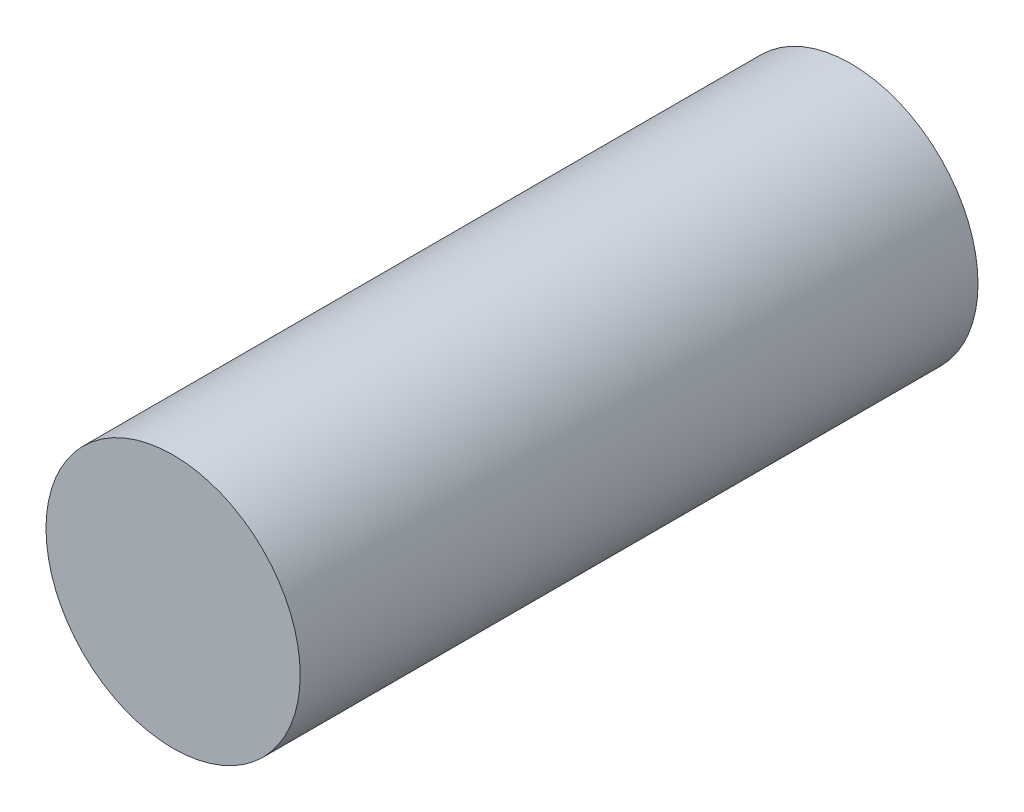
ISO-10303-21;
HEADER;
FILE_DESCRIPTION(('STEP AP214'),'2;1');
FILE_NAME('part.step','',(''),(''),'','','');
FILE_SCHEMA(('AUTOMOTIVE_DESIGN { 1 0 10303 214 1 1 1 1 }'));
ENDSEC;
DATA;
#1=APPLICATION_CONTEXT('core data for automotive mechanical design processes');
#2=APPLICATION_PROTOCOL_DEFINITION('international standard','automotive_design',2000,#1);
#3=PRODUCT_CONTEXT('',#1,'mechanical');
#4=PRODUCT('Part','Part','',(#3));
#5=PRODUCT_RELATED_PRODUCT_CATEGORY('part','',(#4));
#6=PRODUCT_DEFINITION_FORMATION('','',#4);
#7=PRODUCT_DEFINITION_CONTEXT('part definition',#1,'design');
#8=PRODUCT_DEFINITION('design','',#6,#7);
#9=PRODUCT_DEFINITION_SHAPE('','',#8);
#10=(LENGTH_UNIT() NAMED_UNIT(*) SI_UNIT(.MILLI.,.METRE.));
#11=(NAMED_UNIT(*) PLANE_ANGLE_UNIT() SI_UNIT($,.RADIAN.));
#12=(NAMED_UNIT(*) SI_UNIT($,.STERADIAN.) SOLID_ANGLE_UNIT());
#13=UNCERTAINTY_MEASURE_WITH_UNIT(LENGTH_MEASURE(1.E-05),#10,'distance_accuracy_value','');
#14=(GEOMETRIC_REPRESENTATION_CONTEXT(3) GLOBAL_UNCERTAINTY_ASSIGNED_CONTEXT((#13)) GLOBAL_UNIT_ASSIGNED_CONTEXT((#10,
#11,#12)) REPRESENTATION_CONTEXT('',''));
#15=CARTESIAN_POINT('',(0.,0.,0.));
#16=DIRECTION('',(0.,0.,1.));
#17=DIRECTION('',(1.,0.,0.));
#18=AXIS2_PLACEMENT_3D('',#15,#16,#17);
#19=CARTESIAN_POINT('',(0.,0.,8.));
#20=DIRECTION('',(0.,0.,-1.));
#21=DIRECTION('',(-1.,0.,0.));
#22=AXIS2_PLACEMENT_3D('',#19,#20,#21);
#23=CYLINDRICAL_SURFACE('',#22,1.5);
#24=CARTESIAN_POINT('',(0.,0.,8.));
#25=DIRECTION('',(0.,0.,1.));
#26=DIRECTION('',(1.,0.,0.));
#27=AXIS2_PLACEMENT_3D('',#24,#25,#26);
#28=CIRCLE('',#27,1.5);
#29=CARTESIAN_POINT('',(1.5,0.,8.));
#30=VERTEX_POINT('',#29);
#31=EDGE_CURVE('E10',#30,#30,#28,.T.);
#32=ORIENTED_EDGE('',*,*,#31,.F.);
#33=EDGE_LOOP('',(#32));
#34=FACE_BOUND('',#33,.T.);
#35=CARTESIAN_POINT('',(0.,0.,0.));
#36=DIRECTION('',(0.,0.,1.));
#37=DIRECTION('',(1.,0.,0.));
#38=AXIS2_PLACEMENT_3D('',#35,#36,#37);
#39=CIRCLE('',#38,1.5);
#40=CARTESIAN_POINT('',(1.5,0.,0.));
#41=VERTEX_POINT('',#40);
#42=EDGE_CURVE('E40',#41,#41,#39,.T.);
#43=ORIENTED_EDGE('',*,*,#42,.T.);
#44=EDGE_LOOP('',(#43));
#45=FACE_BOUND('',#44,.T.);
#46=ADVANCED_FACE('F37',(#34,#45),#23,.T.);
#47=CARTESIAN_POINT('',(0.,0.,8.));
#48=DIRECTION('',(0.,0.,1.));
#49=DIRECTION('',(1.,0.,0.));
#50=AXIS2_PLACEMENT_3D('',#47,#48,#49);
#51=PLANE('',#50);
#52=ORIENTED_EDGE('',*,*,#31,.T.);
#53=EDGE_LOOP('',(#52));
#54=FACE_BOUND('',#53,.T.);
#55=ADVANCED_FACE('F54',(#54),#51,.T.);
#56=CARTESIAN_POINT('',(0.,0.,0.));
#57=DIRECTION('',(0.,0.,1.));
#58=DIRECTION('',(1.,0.,0.));
#59=AXIS2_PLACEMENT_3D('',#56,#57,#58);
#60=PLANE('',#59);
#61=ORIENTED_EDGE('',*,*,#42,.F.);
#62=EDGE_LOOP('',(#61));
#63=FACE_BOUND('',#62,.T.);
#64=ADVANCED_FACE('F52',(#63),#60,.F.);
#65=CLOSED_SHELL('',(#46,#55,#64));
#66=MANIFOLD_SOLID_BREP('B2',#65);
#67=ADVANCED_BREP_SHAPE_REPRESENTATION('',(#18,#66),#14);
#68=SHAPE_DEFINITION_REPRESENTATION(#9,#67);
ENDSEC;
END-ISO-10303-21;
